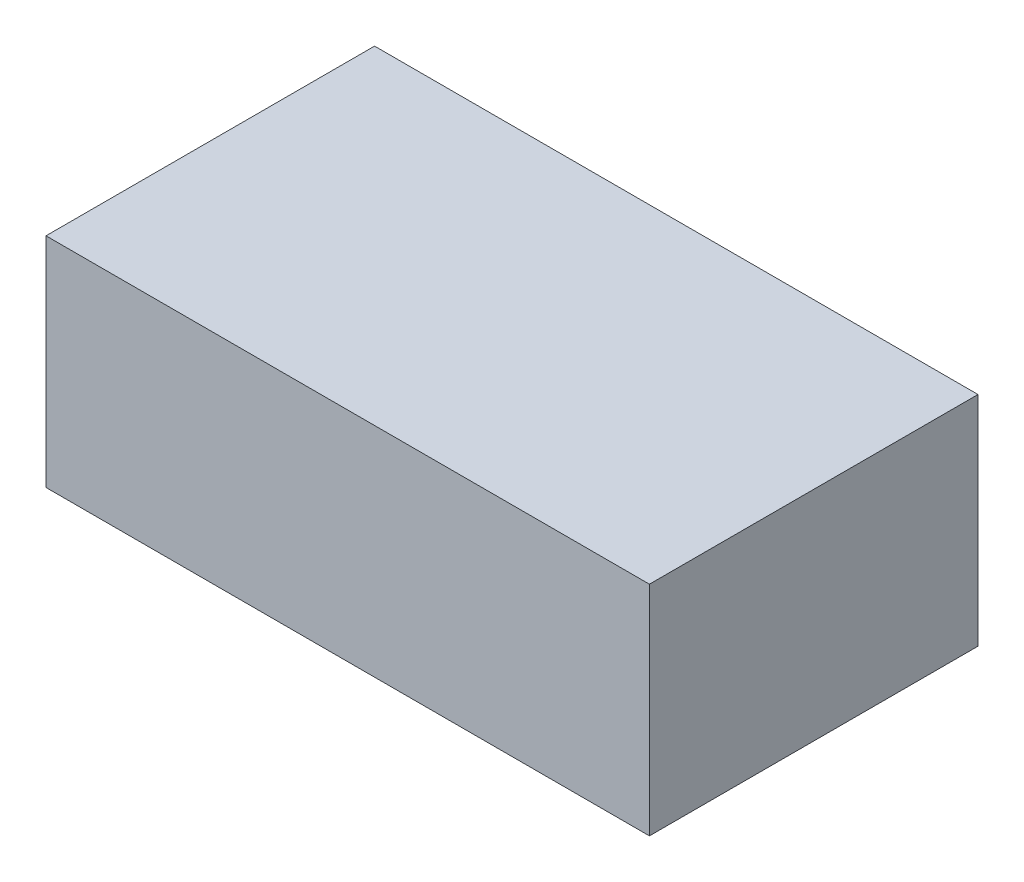
ISO-10303-21;
HEADER;
FILE_DESCRIPTION(('STEP AP214'),'2;1');
FILE_NAME('part.step','',(''),(''),'','','');
FILE_SCHEMA(('AUTOMOTIVE_DESIGN { 1 0 10303 214 1 1 1 1 }'));
ENDSEC;
DATA;
#1=APPLICATION_CONTEXT('core data for automotive mechanical design processes');
#2=APPLICATION_PROTOCOL_DEFINITION('international standard','automotive_design',2000,#1);
#3=PRODUCT_CONTEXT('',#1,'mechanical');
#4=PRODUCT('Part','Part','',(#3));
#5=PRODUCT_RELATED_PRODUCT_CATEGORY('part','',(#4));
#6=PRODUCT_DEFINITION_FORMATION('','',#4);
#7=PRODUCT_DEFINITION_CONTEXT('part definition',#1,'design');
#8=PRODUCT_DEFINITION('design','',#6,#7);
#9=PRODUCT_DEFINITION_SHAPE('','',#8);
#10=(LENGTH_UNIT() NAMED_UNIT(*) SI_UNIT(.MILLI.,.METRE.));
#11=(NAMED_UNIT(*) PLANE_ANGLE_UNIT() SI_UNIT($,.RADIAN.));
#12=(NAMED_UNIT(*) SI_UNIT($,.STERADIAN.) SOLID_ANGLE_UNIT());
#13=UNCERTAINTY_MEASURE_WITH_UNIT(LENGTH_MEASURE(1.E-05),#10,'distance_accuracy_value','');
#14=(GEOMETRIC_REPRESENTATION_CONTEXT(3) GLOBAL_UNCERTAINTY_ASSIGNED_CONTEXT((#13)) GLOBAL_UNIT_ASSIGNED_CONTEXT((#10,
#11,#12)) REPRESENTATION_CONTEXT('',''));
#15=CARTESIAN_POINT('',(0.,0.,0.));
#16=DIRECTION('',(0.,0.,1.));
#17=DIRECTION('',(1.,0.,0.));
#18=AXIS2_PLACEMENT_3D('',#15,#16,#17);
#19=CARTESIAN_POINT('',(-24.257,17.526,13.208));
#20=DIRECTION('',(1.,0.,0.));
#21=DIRECTION('',(0.,0.,-1.));
#22=AXIS2_PLACEMENT_3D('',#19,#20,#21);
#23=PLANE('',#22);
#24=DIRECTION('',(0.,0.,1.));
#25=VECTOR('',#24,1.);
#26=CARTESIAN_POINT('',(-24.257,0.,13.208));
#27=LINE('',#26,#25);
#28=CARTESIAN_POINT('',(-24.257,0.,-13.208));
#29=VERTEX_POINT('',#28);
#30=CARTESIAN_POINT('',(-24.257,0.,13.208));
#31=VERTEX_POINT('',#30);
#32=EDGE_CURVE('E115',#29,#31,#27,.T.);
#33=ORIENTED_EDGE('',*,*,#32,.T.);
#34=DIRECTION('',(0.,-1.,0.));
#35=VECTOR('',#34,1.);
#36=CARTESIAN_POINT('',(-24.257,17.526,13.208));
#37=LINE('',#36,#35);
#38=CARTESIAN_POINT('',(-24.257,17.526,13.208));
#39=VERTEX_POINT('',#38);
#40=EDGE_CURVE('E11',#39,#31,#37,.T.);
#41=ORIENTED_EDGE('',*,*,#40,.F.);
#42=DIRECTION('',(0.,0.,1.));
#43=VECTOR('',#42,1.);
#44=CARTESIAN_POINT('',(-24.257,17.526,13.208));
#45=LINE('',#44,#43);
#46=CARTESIAN_POINT('',(-24.257,17.526,-13.208));
#47=VERTEX_POINT('',#46);
#48=EDGE_CURVE('E99',#47,#39,#45,.T.);
#49=ORIENTED_EDGE('',*,*,#48,.F.);
#50=DIRECTION('',(0.,-1.,0.));
#51=VECTOR('',#50,1.);
#52=CARTESIAN_POINT('',(-24.257,17.526,-13.208));
#53=LINE('',#52,#51);
#54=EDGE_CURVE('E111',#47,#29,#53,.T.);
#55=ORIENTED_EDGE('',*,*,#54,.T.);
#56=EDGE_LOOP('',(#33,#41,#49,#55));
#57=FACE_BOUND('',#56,.T.);
#58=ADVANCED_FACE('F47',(#57),#23,.F.);
#59=CARTESIAN_POINT('',(24.257,17.526,13.208));
#60=DIRECTION('',(0.,0.,-1.));
#61=DIRECTION('',(-1.,0.,0.));
#62=AXIS2_PLACEMENT_3D('',#59,#60,#61);
#63=PLANE('',#62);
#64=DIRECTION('',(1.,0.,0.));
#65=VECTOR('',#64,1.);
#66=CARTESIAN_POINT('',(24.257,0.,13.208));
#67=LINE('',#66,#65);
#68=CARTESIAN_POINT('',(24.257,0.,13.208));
#69=VERTEX_POINT('',#68);
#70=EDGE_CURVE('E104',#31,#69,#67,.T.);
#71=ORIENTED_EDGE('',*,*,#70,.T.);
#72=DIRECTION('',(0.,-1.,0.));
#73=VECTOR('',#72,1.);
#74=CARTESIAN_POINT('',(24.257,17.526,13.208));
#75=LINE('',#74,#73);
#76=CARTESIAN_POINT('',(24.257,17.526,13.208));
#77=VERTEX_POINT('',#76);
#78=EDGE_CURVE('E56',#77,#69,#75,.T.);
#79=ORIENTED_EDGE('',*,*,#78,.F.);
#80=DIRECTION('',(1.,0.,0.));
#81=VECTOR('',#80,1.);
#82=CARTESIAN_POINT('',(24.257,17.526,13.208));
#83=LINE('',#82,#81);
#84=EDGE_CURVE('E94',#39,#77,#83,.T.);
#85=ORIENTED_EDGE('',*,*,#84,.F.);
#86=ORIENTED_EDGE('',*,*,#40,.T.);
#87=EDGE_LOOP('',(#71,#79,#85,#86));
#88=FACE_BOUND('',#87,.T.);
#89=ADVANCED_FACE('F103',(#88),#63,.F.);
#90=CARTESIAN_POINT('',(24.257,17.526,13.208));
#91=DIRECTION('',(-1.,0.,0.));
#92=DIRECTION('',(0.,0.,1.));
#93=AXIS2_PLACEMENT_3D('',#90,#91,#92);
#94=PLANE('',#93);
#95=DIRECTION('',(0.,0.,-1.));
#96=VECTOR('',#95,1.);
#97=CARTESIAN_POINT('',(24.257,0.,13.208));
#98=LINE('',#97,#96);
#99=CARTESIAN_POINT('',(24.257,0.,-13.208));
#100=VERTEX_POINT('',#99);
#101=EDGE_CURVE('E81',#69,#100,#98,.T.);
#102=ORIENTED_EDGE('',*,*,#101,.T.);
#103=DIRECTION('',(0.,-1.,0.));
#104=VECTOR('',#103,1.);
#105=CARTESIAN_POINT('',(24.257,17.526,-13.208));
#106=LINE('',#105,#104);
#107=CARTESIAN_POINT('',(24.257,17.526,-13.208));
#108=VERTEX_POINT('',#107);
#109=EDGE_CURVE('E106',#108,#100,#106,.T.);
#110=ORIENTED_EDGE('',*,*,#109,.F.);
#111=DIRECTION('',(0.,0.,-1.));
#112=VECTOR('',#111,1.);
#113=CARTESIAN_POINT('',(24.257,17.526,13.208));
#114=LINE('',#113,#112);
#115=EDGE_CURVE('E97',#77,#108,#114,.T.);
#116=ORIENTED_EDGE('',*,*,#115,.F.);
#117=ORIENTED_EDGE('',*,*,#78,.T.);
#118=EDGE_LOOP('',(#102,#110,#116,#117));
#119=FACE_BOUND('',#118,.T.);
#120=ADVANCED_FACE('F107',(#119),#94,.F.);
#121=CARTESIAN_POINT('',(24.257,17.526,-13.208));
#122=DIRECTION('',(0.,0.,1.));
#123=DIRECTION('',(1.,0.,0.));
#124=AXIS2_PLACEMENT_3D('',#121,#122,#123);
#125=PLANE('',#124);
#126=DIRECTION('',(-1.,0.,0.));
#127=VECTOR('',#126,1.);
#128=CARTESIAN_POINT('',(24.257,0.,-13.208));
#129=LINE('',#128,#127);
#130=EDGE_CURVE('E87',#100,#29,#129,.T.);
#131=ORIENTED_EDGE('',*,*,#130,.T.);
#132=ORIENTED_EDGE('',*,*,#54,.F.);
#133=DIRECTION('',(-1.,0.,0.));
#134=VECTOR('',#133,1.);
#135=CARTESIAN_POINT('',(24.257,17.526,-13.208));
#136=LINE('',#135,#134);
#137=EDGE_CURVE('E64',#108,#47,#136,.T.);
#138=ORIENTED_EDGE('',*,*,#137,.F.);
#139=ORIENTED_EDGE('',*,*,#109,.T.);
#140=EDGE_LOOP('',(#131,#132,#138,#139));
#141=FACE_BOUND('',#140,.T.);
#142=ADVANCED_FACE('F128',(#141),#125,.F.);
#143=CARTESIAN_POINT('',(0.,17.526,0.));
#144=DIRECTION('',(0.,1.,0.));
#145=DIRECTION('',(0.,0.,1.));
#146=AXIS2_PLACEMENT_3D('',#143,#144,#145);
#147=PLANE('',#146);
#148=ORIENTED_EDGE('',*,*,#48,.T.);
#149=ORIENTED_EDGE('',*,*,#84,.T.);
#150=ORIENTED_EDGE('',*,*,#115,.T.);
#151=ORIENTED_EDGE('',*,*,#137,.T.);
#152=EDGE_LOOP('',(#148,#149,#150,#151));
#153=FACE_BOUND('',#152,.T.);
#154=ADVANCED_FACE('F95',(#153),#147,.T.);
#155=CARTESIAN_POINT('',(0.,0.,0.));
#156=DIRECTION('',(0.,1.,0.));
#157=DIRECTION('',(0.,0.,1.));
#158=AXIS2_PLACEMENT_3D('',#155,#156,#157);
#159=PLANE('',#158);
#160=ORIENTED_EDGE('',*,*,#32,.F.);
#161=ORIENTED_EDGE('',*,*,#130,.F.);
#162=ORIENTED_EDGE('',*,*,#101,.F.);
#163=ORIENTED_EDGE('',*,*,#70,.F.);
#164=EDGE_LOOP('',(#160,#161,#162,#163));
#165=FACE_BOUND('',#164,.T.);
#166=ADVANCED_FACE('F131',(#165),#159,.F.);
#167=CLOSED_SHELL('',(#58,#89,#120,#142,#154,#166));
#168=MANIFOLD_SOLID_BREP('B2',#167);
#169=ADVANCED_BREP_SHAPE_REPRESENTATION('',(#18,#168),#14);
#170=SHAPE_DEFINITION_REPRESENTATION(#9,#169);
ENDSEC;
END-ISO-10303-21;
